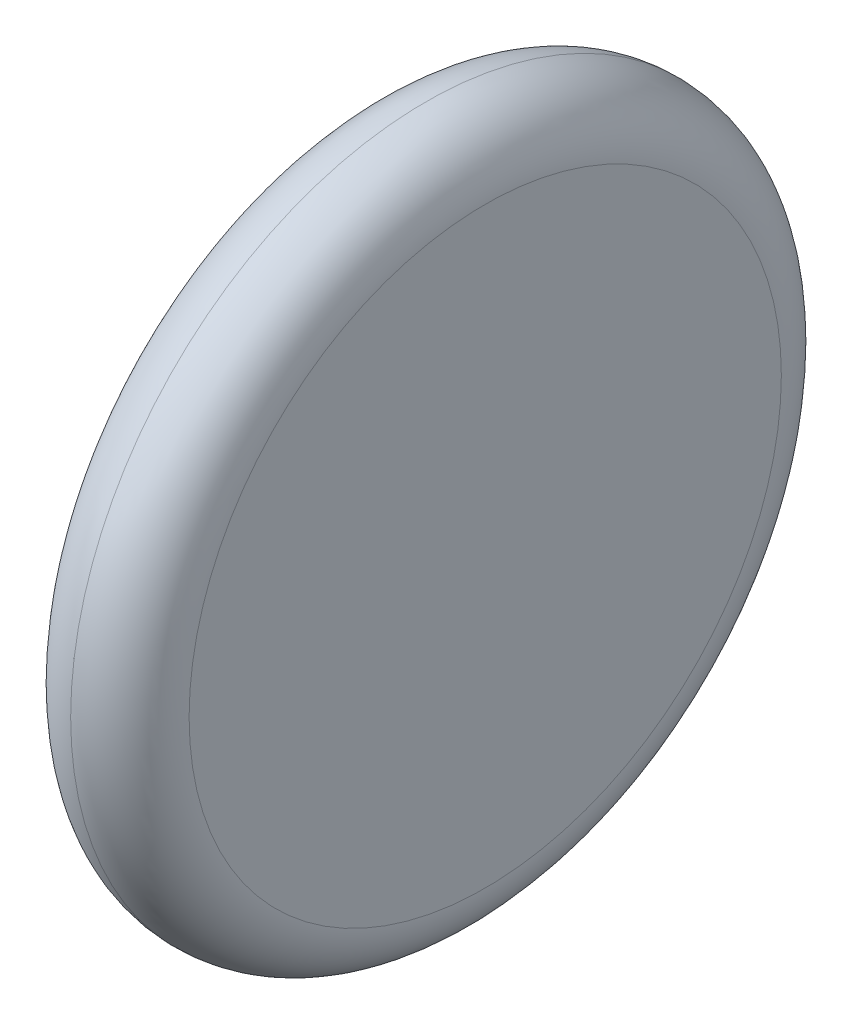
ISO-10303-21;
HEADER;
FILE_DESCRIPTION(('STEP AP214'),'2;1');
FILE_NAME('part.step','',(''),(''),'','','');
FILE_SCHEMA(('AUTOMOTIVE_DESIGN { 1 0 10303 214 1 1 1 1 }'));
ENDSEC;
DATA;
#1=APPLICATION_CONTEXT('core data for automotive mechanical design processes');
#2=APPLICATION_PROTOCOL_DEFINITION('international standard','automotive_design',2000,#1);
#3=PRODUCT_CONTEXT('',#1,'mechanical');
#4=PRODUCT('Part','Part','',(#3));
#5=PRODUCT_RELATED_PRODUCT_CATEGORY('part','',(#4));
#6=PRODUCT_DEFINITION_FORMATION('','',#4);
#7=PRODUCT_DEFINITION_CONTEXT('part definition',#1,'design');
#8=PRODUCT_DEFINITION('design','',#6,#7);
#9=PRODUCT_DEFINITION_SHAPE('','',#8);
#10=(LENGTH_UNIT() NAMED_UNIT(*) SI_UNIT(.MILLI.,.METRE.));
#11=(NAMED_UNIT(*) PLANE_ANGLE_UNIT() SI_UNIT($,.RADIAN.));
#12=(NAMED_UNIT(*) SI_UNIT($,.STERADIAN.) SOLID_ANGLE_UNIT());
#13=UNCERTAINTY_MEASURE_WITH_UNIT(LENGTH_MEASURE(1.E-05),#10,'distance_accuracy_value','');
#14=(GEOMETRIC_REPRESENTATION_CONTEXT(3) GLOBAL_UNCERTAINTY_ASSIGNED_CONTEXT((#13)) GLOBAL_UNIT_ASSIGNED_CONTEXT((#10,
#11,#12)) REPRESENTATION_CONTEXT('',''));
#15=CARTESIAN_POINT('',(0.,0.,0.));
#16=DIRECTION('',(0.,0.,1.));
#17=DIRECTION('',(1.,0.,0.));
#18=AXIS2_PLACEMENT_3D('',#15,#16,#17);
#19=CARTESIAN_POINT('',(30.,0.,0.));
#20=DIRECTION('',(1.,0.,0.));
#21=DIRECTION('',(0.,0.,-1.));
#22=AXIS2_PLACEMENT_3D('',#19,#20,#21);
#23=PLANE('',#22);
#24=CARTESIAN_POINT('',(30.,0.,0.));
#25=DIRECTION('',(1.,0.,0.));
#26=DIRECTION('',(0.,0.,-1.));
#27=AXIS2_PLACEMENT_3D('',#24,#25,#26);
#28=CIRCLE('',#27,75.);
#29=CARTESIAN_POINT('',(30.,0.,-75.));
#30=VERTEX_POINT('',#29);
#31=EDGE_CURVE('E10',#30,#30,#28,.T.);
#32=ORIENTED_EDGE('',*,*,#31,.T.);
#33=EDGE_LOOP('',(#32));
#34=FACE_BOUND('',#33,.T.);
#35=ADVANCED_FACE('F36',(#34),#23,.T.);
#36=CARTESIAN_POINT('',(0.,0.,0.));
#37=DIRECTION('',(1.,0.,0.));
#38=DIRECTION('',(0.,0.,-1.));
#39=AXIS2_PLACEMENT_3D('',#36,#37,#38);
#40=PLANE('',#39);
#41=CARTESIAN_POINT('',(0.,0.,0.));
#42=DIRECTION('',(1.,0.,0.));
#43=DIRECTION('',(0.,0.,-1.));
#44=AXIS2_PLACEMENT_3D('',#41,#42,#43);
#45=CIRCLE('',#44,75.);
#46=CARTESIAN_POINT('',(0.,0.,-75.));
#47=VERTEX_POINT('',#46);
#48=EDGE_CURVE('E44',#47,#47,#45,.F.);
#49=ORIENTED_EDGE('',*,*,#48,.T.);
#50=EDGE_LOOP('',(#49));
#51=FACE_BOUND('',#50,.T.);
#52=ADVANCED_FACE('F57',(#51),#40,.F.);
#53=CARTESIAN_POINT('',(15.,0.,0.));
#54=DIRECTION('',(1.,0.,0.));
#55=DIRECTION('',(0.,0.,-1.));
#56=AXIS2_PLACEMENT_3D('',#53,#54,#55);
#57=TOROIDAL_SURFACE('',#56,75.,15.);
#58=ORIENTED_EDGE('',*,*,#31,.F.);
#59=EDGE_LOOP('',(#58));
#60=FACE_BOUND('',#59,.T.);
#61=CARTESIAN_POINT('',(15.,0.,0.));
#62=DIRECTION('',(1.,0.,0.));
#63=DIRECTION('',(0.,0.,-1.));
#64=AXIS2_PLACEMENT_3D('',#61,#62,#63);
#65=CIRCLE('',#64,90.);
#66=CARTESIAN_POINT('',(15.,0.,-90.));
#67=VERTEX_POINT('',#66);
#68=EDGE_CURVE('E40',#67,#67,#65,.F.);
#69=ORIENTED_EDGE('',*,*,#68,.F.);
#70=EDGE_LOOP('',(#69));
#71=FACE_BOUND('',#70,.T.);
#72=ADVANCED_FACE('F38',(#60,#71),#57,.T.);
#73=CARTESIAN_POINT('',(15.,0.,0.));
#74=DIRECTION('',(1.,0.,0.));
#75=DIRECTION('',(0.,0.,-1.));
#76=AXIS2_PLACEMENT_3D('',#73,#74,#75);
#77=TOROIDAL_SURFACE('',#76,75.,15.);
#78=ORIENTED_EDGE('',*,*,#48,.F.);
#79=EDGE_LOOP('',(#78));
#80=FACE_BOUND('',#79,.T.);
#81=ORIENTED_EDGE('',*,*,#68,.T.);
#82=EDGE_LOOP('',(#81));
#83=FACE_BOUND('',#82,.T.);
#84=ADVANCED_FACE('F54',(#80,#83),#77,.T.);
#85=CLOSED_SHELL('',(#35,#52,#72,#84));
#86=MANIFOLD_SOLID_BREP('B2',#85);
#87=ADVANCED_BREP_SHAPE_REPRESENTATION('',(#18,#86),#14);
#88=SHAPE_DEFINITION_REPRESENTATION(#9,#87);
ENDSEC;
END-ISO-10303-21;
